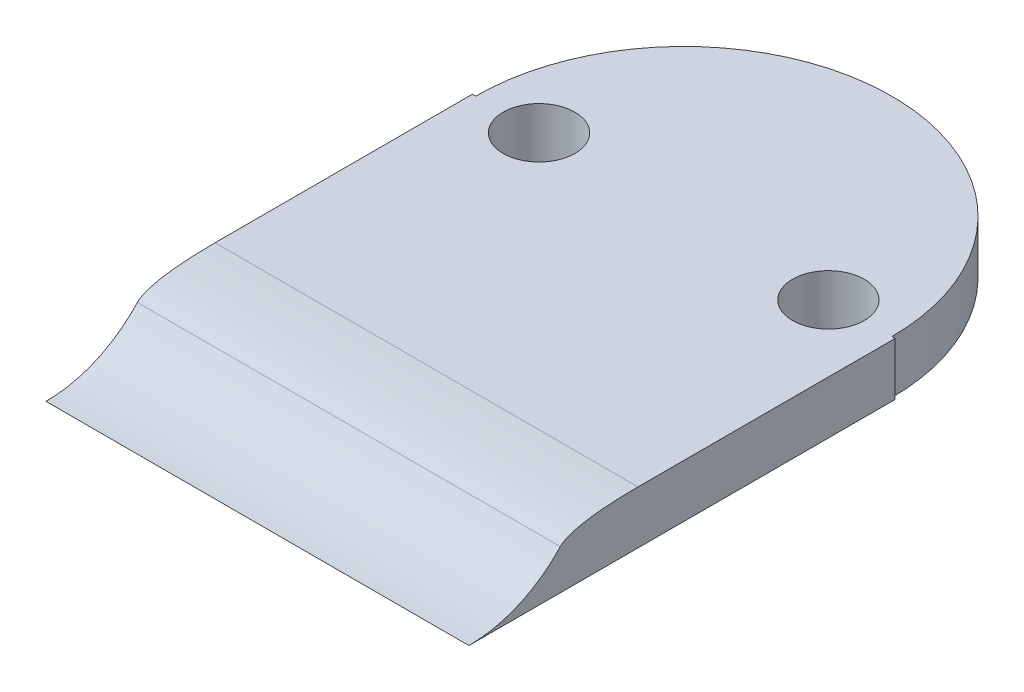
ISO-10303-21;
HEADER;
FILE_DESCRIPTION(('STEP AP214'),'2;1');
FILE_NAME('part.step','',(''),(''),'','','');
FILE_SCHEMA(('AUTOMOTIVE_DESIGN { 1 0 10303 214 1 1 1 1 }'));
ENDSEC;
DATA;
#1=APPLICATION_CONTEXT('core data for automotive mechanical design processes');
#2=APPLICATION_PROTOCOL_DEFINITION('international standard','automotive_design',2000,#1);
#3=PRODUCT_CONTEXT('',#1,'mechanical');
#4=PRODUCT('Part','Part','',(#3));
#5=PRODUCT_RELATED_PRODUCT_CATEGORY('part','',(#4));
#6=PRODUCT_DEFINITION_FORMATION('','',#4);
#7=PRODUCT_DEFINITION_CONTEXT('part definition',#1,'design');
#8=PRODUCT_DEFINITION('design','',#6,#7);
#9=PRODUCT_DEFINITION_SHAPE('','',#8);
#10=(LENGTH_UNIT() NAMED_UNIT(*) SI_UNIT(.MILLI.,.METRE.));
#11=(NAMED_UNIT(*) PLANE_ANGLE_UNIT() SI_UNIT($,.RADIAN.));
#12=(NAMED_UNIT(*) SI_UNIT($,.STERADIAN.) SOLID_ANGLE_UNIT());
#13=UNCERTAINTY_MEASURE_WITH_UNIT(LENGTH_MEASURE(1.E-05),#10,'distance_accuracy_value','');
#14=(GEOMETRIC_REPRESENTATION_CONTEXT(3) GLOBAL_UNCERTAINTY_ASSIGNED_CONTEXT((#13)) GLOBAL_UNIT_ASSIGNED_CONTEXT((#10,
#11,#12)) REPRESENTATION_CONTEXT('',''));
#15=CARTESIAN_POINT('',(0.,0.,0.));
#16=DIRECTION('',(0.,0.,1.));
#17=DIRECTION('',(1.,0.,0.));
#18=AXIS2_PLACEMENT_3D('',#15,#16,#17);
#19=CARTESIAN_POINT('',(12.7,88.9,0.));
#20=DIRECTION('',(0.,-1.,0.));
#21=DIRECTION('',(1.,0.,0.));
#22=AXIS2_PLACEMENT_3D('',#19,#20,#21);
#23=PLANE('',#22);
#24=CARTESIAN_POINT('',(-8.68927197393336,88.9,-19.05));
#25=DIRECTION('',(0.,-1.,0.));
#26=DIRECTION('',(1.,0.,0.));
#27=AXIS2_PLACEMENT_3D('',#24,#25,#26);
#28=CIRCLE('',#27,2.15264999999999);
#29=CARTESIAN_POINT('',(-6.53662197393337,88.9,-19.05));
#30=VERTEX_POINT('',#29);
#31=EDGE_CURVE('E168',#30,#30,#28,.T.);
#32=ORIENTED_EDGE('',*,*,#31,.T.);
#33=EDGE_LOOP('',(#32));
#34=FACE_BOUND('',#33,.T.);
#35=CARTESIAN_POINT('',(8.69072802606665,88.9,-19.05));
#36=DIRECTION('',(0.,-1.,0.));
#37=DIRECTION('',(1.,0.,0.));
#38=AXIS2_PLACEMENT_3D('',#35,#36,#37);
#39=CIRCLE('',#38,2.15264999999999);
#40=CARTESIAN_POINT('',(10.8433780260666,88.9,-19.05));
#41=VERTEX_POINT('',#40);
#42=EDGE_CURVE('E173',#41,#41,#39,.T.);
#43=ORIENTED_EDGE('',*,*,#42,.T.);
#44=EDGE_LOOP('',(#43));
#45=FACE_BOUND('',#44,.T.);
#46=DIRECTION('',(0.,0.,1.));
#47=VECTOR('',#46,1.);
#48=CARTESIAN_POINT('',(-12.7,88.9,0.));
#49=LINE('',#48,#47);
#50=CARTESIAN_POINT('',(-12.7,88.9,-19.05));
#51=VERTEX_POINT('',#50);
#52=CARTESIAN_POINT('',(-12.7,88.9,-3.60372173028903));
#53=VERTEX_POINT('',#52);
#54=EDGE_CURVE('E186',#51,#53,#49,.T.);
#55=ORIENTED_EDGE('',*,*,#54,.T.);
#56=CARTESIAN_POINT('',(13.97,88.9,-3.60372173028903));
#57=CARTESIAN_POINT('',(4.65666666666666,88.9,-3.60372173028903));
#58=CARTESIAN_POINT('',(-4.65666666666668,88.9,-3.60372173028903));
#59=CARTESIAN_POINT('',(-13.97,88.9,-3.60372173028903));
#60=(BOUNDED_CURVE() B_SPLINE_CURVE(3,(#56,#57,#58,#59),.UNSPECIFIED.,.F.,
.F.) B_SPLINE_CURVE_WITH_KNOTS((4,4),(-0.00127,0.02667),
.UNSPECIFIED.) CURVE() GEOMETRIC_REPRESENTATION_ITEM() RATIONAL_B_SPLINE_CURVE((1.,1.,1.,1.)) REPRESENTATION_ITEM(''));
#61=CARTESIAN_POINT('',(12.7,88.9,-3.60372173028903));
#62=VERTEX_POINT('',#61);
#63=EDGE_CURVE('E89',#53,#62,#60,.F.);
#64=ORIENTED_EDGE('',*,*,#63,.T.);
#65=DIRECTION('',(0.,0.,1.));
#66=VECTOR('',#65,1.);
#67=CARTESIAN_POINT('',(12.7,88.9,0.));
#68=LINE('',#67,#66);
#69=CARTESIAN_POINT('',(12.7,88.9,-19.05));
#70=VERTEX_POINT('',#69);
#71=EDGE_CURVE('E153',#70,#62,#68,.T.);
#72=ORIENTED_EDGE('',*,*,#71,.F.);
#73=DIRECTION('',(-1.,0.,0.));
#74=VECTOR('',#73,1.);
#75=CARTESIAN_POINT('',(12.7000000000003,88.9,-19.05));
#76=LINE('',#75,#74);
#77=CARTESIAN_POINT('',(12.5007280260666,88.9,-19.05));
#78=VERTEX_POINT('',#77);
#79=EDGE_CURVE('E287',#70,#78,#76,.T.);
#80=ORIENTED_EDGE('',*,*,#79,.T.);
#81=CARTESIAN_POINT('',(0.000728026066644889,88.9,-19.05));
#82=DIRECTION('',(0.,-1.,0.));
#83=DIRECTION('',(1.,0.,0.));
#84=AXIS2_PLACEMENT_3D('',#81,#82,#83);
#85=CIRCLE('',#84,12.5);
#86=CARTESIAN_POINT('',(-12.4992719739334,88.9,-19.05));
#87=VERTEX_POINT('',#86);
#88=EDGE_CURVE('E177',#87,#78,#85,.T.);
#89=ORIENTED_EDGE('',*,*,#88,.F.);
#90=DIRECTION('',(-1.,0.,0.));
#91=VECTOR('',#90,1.);
#92=CARTESIAN_POINT('',(12.6999999999997,88.9,-19.0500000000004));
#93=LINE('',#92,#91);
#94=EDGE_CURVE('E170',#87,#51,#93,.T.);
#95=ORIENTED_EDGE('',*,*,#94,.T.);
#96=EDGE_LOOP('',(#55,#64,#72,#80,#89,#95));
#97=FACE_BOUND('',#96,.T.);
#98=ADVANCED_FACE('F75',(#34,#45,#97),#23,.F.);
#99=CARTESIAN_POINT('',(-12.7,85.725,0.));
#100=DIRECTION('',(1.,0.,0.));
#101=DIRECTION('',(0.,1.,0.));
#102=AXIS2_PLACEMENT_3D('',#99,#100,#101);
#103=PLANE('',#102);
#104=DIRECTION('',(0.,1.,0.));
#105=VECTOR('',#104,1.);
#106=CARTESIAN_POINT('',(-12.7,55.753,-19.05));
#107=LINE('',#106,#105);
#108=CARTESIAN_POINT('',(-12.7,85.725,-19.05));
#109=VERTEX_POINT('',#108);
#110=EDGE_CURVE('E158',#109,#51,#107,.T.);
#111=ORIENTED_EDGE('',*,*,#110,.F.);
#112=DIRECTION('',(0.,0.,1.));
#113=VECTOR('',#112,1.);
#114=CARTESIAN_POINT('',(-12.7,85.725,0.));
#115=LINE('',#114,#113);
#116=CARTESIAN_POINT('',(-12.7,85.725,6.55));
#117=VERTEX_POINT('',#116);
#118=EDGE_CURVE('E144',#109,#117,#115,.T.);
#119=ORIENTED_EDGE('',*,*,#118,.T.);
#120=CARTESIAN_POINT('',(-12.7,93.1945826744818,6.55));
#121=DIRECTION('',(-1.,0.,0.));
#122=DIRECTION('',(0.,-1.,0.));
#123=AXIS2_PLACEMENT_3D('',#120,#121,#122);
#124=CIRCLE('',#123,7.46958267448183);
#125=CARTESIAN_POINT('',(-12.7,88.1275540980612,1.06184122526909));
#126=VERTEX_POINT('',#125);
#127=EDGE_CURVE('E157',#117,#126,#124,.F.);
#128=ORIENTED_EDGE('',*,*,#127,.T.);
#129=CARTESIAN_POINT('',(-12.7,88.9,-3.60372173028903));
#130=CARTESIAN_POINT('',(-12.7,88.9,0.348668443737298));
#131=CARTESIAN_POINT('',(-12.7,88.1275540980612,1.06184122526909));
#132=(BOUNDED_CURVE() B_SPLINE_CURVE(2,(#129,#130,#131),.UNSPECIFIED.,.F.,
.F.) B_SPLINE_CURVE_WITH_KNOTS((3,3),(0.,1.),
.UNSPECIFIED.) CURVE() GEOMETRIC_REPRESENTATION_ITEM() RATIONAL_B_SPLINE_CURVE((1.,
0.916066312030037,1.)) REPRESENTATION_ITEM(''));
#133=EDGE_CURVE('E104',#126,#53,#132,.F.);
#134=ORIENTED_EDGE('',*,*,#133,.T.);
#135=ORIENTED_EDGE('',*,*,#54,.F.);
#136=EDGE_LOOP('',(#111,#119,#128,#134,#135));
#137=FACE_BOUND('',#136,.T.);
#138=ADVANCED_FACE('F156',(#137),#103,.F.);
#139=CARTESIAN_POINT('',(12.7,85.725,0.));
#140=DIRECTION('',(-1.,0.,0.));
#141=DIRECTION('',(0.,-1.,0.));
#142=AXIS2_PLACEMENT_3D('',#139,#140,#141);
#143=PLANE('',#142);
#144=CARTESIAN_POINT('',(12.7,93.1945826744818,6.55));
#145=DIRECTION('',(-1.,0.,0.));
#146=DIRECTION('',(0.,-1.,0.));
#147=AXIS2_PLACEMENT_3D('',#144,#145,#146);
#148=CIRCLE('',#147,7.46958267448183);
#149=CARTESIAN_POINT('',(12.7,85.725,6.55));
#150=VERTEX_POINT('',#149);
#151=CARTESIAN_POINT('',(12.7,88.1275540980612,1.06184122526909));
#152=VERTEX_POINT('',#151);
#153=EDGE_CURVE('E167',#150,#152,#148,.F.);
#154=ORIENTED_EDGE('',*,*,#153,.F.);
#155=DIRECTION('',(0.,0.,-1.));
#156=VECTOR('',#155,1.);
#157=CARTESIAN_POINT('',(12.7,85.725,0.));
#158=LINE('',#157,#156);
#159=CARTESIAN_POINT('',(12.7,85.725,-19.05));
#160=VERTEX_POINT('',#159);
#161=EDGE_CURVE('E147',#150,#160,#158,.T.);
#162=ORIENTED_EDGE('',*,*,#161,.T.);
#163=DIRECTION('',(0.,1.,0.));
#164=VECTOR('',#163,1.);
#165=CARTESIAN_POINT('',(12.7,55.753,-19.05));
#166=LINE('',#165,#164);
#167=EDGE_CURVE('E278',#160,#70,#166,.T.);
#168=ORIENTED_EDGE('',*,*,#167,.T.);
#169=ORIENTED_EDGE('',*,*,#71,.T.);
#170=CARTESIAN_POINT('',(12.7,88.1275540980612,1.06184122526909));
#171=CARTESIAN_POINT('',(12.7,88.9,0.348668443737295));
#172=CARTESIAN_POINT('',(12.7,88.9,-3.60372173028903));
#173=(BOUNDED_CURVE() B_SPLINE_CURVE(2,(#170,#171,#172),.UNSPECIFIED.,.F.,
.F.) B_SPLINE_CURVE_WITH_KNOTS((3,3),(0.,1.),
.UNSPECIFIED.) CURVE() GEOMETRIC_REPRESENTATION_ITEM() RATIONAL_B_SPLINE_CURVE((1.,
0.916066312030038,1.)) REPRESENTATION_ITEM(''));
#174=EDGE_CURVE('E14',#62,#152,#173,.F.);
#175=ORIENTED_EDGE('',*,*,#174,.T.);
#176=EDGE_LOOP('',(#154,#162,#168,#169,#175));
#177=FACE_BOUND('',#176,.T.);
#178=ADVANCED_FACE('F222',(#177),#143,.F.);
#179=CARTESIAN_POINT('',(0.000728026066649417,55.753,-19.05));
#180=DIRECTION('',(0.,1.,0.));
#181=DIRECTION('',(-1.,0.,0.));
#182=AXIS2_PLACEMENT_3D('',#179,#180,#181);
#183=CYLINDRICAL_SURFACE('',#182,12.5);
#184=CARTESIAN_POINT('',(0.000728026066645323,85.725,-19.05));
#185=DIRECTION('',(0.,1.,0.));
#186=DIRECTION('',(-1.,0.,0.));
#187=AXIS2_PLACEMENT_3D('',#184,#185,#186);
#188=CIRCLE('',#187,12.5);
#189=CARTESIAN_POINT('',(-12.4992719739334,85.725,-19.05));
#190=VERTEX_POINT('',#189);
#191=CARTESIAN_POINT('',(12.5007280260666,85.725,-19.05));
#192=VERTEX_POINT('',#191);
#193=EDGE_CURVE('E296',#190,#192,#188,.F.);
#194=ORIENTED_EDGE('',*,*,#193,.F.);
#195=DIRECTION('',(0.,1.,0.));
#196=VECTOR('',#195,1.);
#197=CARTESIAN_POINT('',(-12.4992719739334,55.753,-19.05));
#198=LINE('',#197,#196);
#199=EDGE_CURVE('E83',#190,#87,#198,.T.);
#200=ORIENTED_EDGE('',*,*,#199,.T.);
#201=ORIENTED_EDGE('',*,*,#88,.T.);
#202=DIRECTION('',(0.,1.,0.));
#203=VECTOR('',#202,1.);
#204=CARTESIAN_POINT('',(12.5007280260666,55.753,-19.05));
#205=LINE('',#204,#203);
#206=EDGE_CURVE('E152',#192,#78,#205,.T.);
#207=ORIENTED_EDGE('',*,*,#206,.F.);
#208=EDGE_LOOP('',(#194,#200,#201,#207));
#209=FACE_BOUND('',#208,.T.);
#210=ADVANCED_FACE('F216',(#209),#183,.T.);
#211=CARTESIAN_POINT('',(-3.25172302705533E-13,55.753,-19.0500000000002));
#212=DIRECTION('',(0.,0.,-1.));
#213=DIRECTION('',(-1.,0.,0.));
#214=AXIS2_PLACEMENT_3D('',#211,#212,#213);
#215=PLANE('',#214);
#216=DIRECTION('',(1.,0.,0.));
#217=VECTOR('',#216,1.);
#218=CARTESIAN_POINT('',(-3.29266250108838E-13,85.725,-19.0500000000002));
#219=LINE('',#218,#217);
#220=EDGE_CURVE('E160',#109,#190,#219,.T.);
#221=ORIENTED_EDGE('',*,*,#220,.F.);
#222=ORIENTED_EDGE('',*,*,#110,.T.);
#223=ORIENTED_EDGE('',*,*,#94,.F.);
#224=ORIENTED_EDGE('',*,*,#199,.F.);
#225=EDGE_LOOP('',(#221,#222,#223,#224));
#226=FACE_BOUND('',#225,.T.);
#227=ADVANCED_FACE('F212',(#226),#215,.T.);
#228=CARTESIAN_POINT('',(3.33360197512138E-13,55.753,-19.0500000000002));
#229=DIRECTION('',(0.,0.,1.));
#230=DIRECTION('',(1.,0.,0.));
#231=AXIS2_PLACEMENT_3D('',#228,#229,#230);
#232=PLANE('',#231);
#233=ORIENTED_EDGE('',*,*,#167,.F.);
#234=DIRECTION('',(-1.,0.,0.));
#235=VECTOR('',#234,1.);
#236=CARTESIAN_POINT('',(3.29266250108832E-13,85.725,-19.0500000000002));
#237=LINE('',#236,#235);
#238=EDGE_CURVE('E298',#160,#192,#237,.T.);
#239=ORIENTED_EDGE('',*,*,#238,.T.);
#240=ORIENTED_EDGE('',*,*,#206,.T.);
#241=ORIENTED_EDGE('',*,*,#79,.F.);
#242=EDGE_LOOP('',(#233,#239,#240,#241));
#243=FACE_BOUND('',#242,.T.);
#244=ADVANCED_FACE('F215',(#243),#232,.F.);
#245=CARTESIAN_POINT('',(12.7,85.725,0.));
#246=DIRECTION('',(0.,1.,0.));
#247=DIRECTION('',(-1.,0.,0.));
#248=AXIS2_PLACEMENT_3D('',#245,#246,#247);
#249=PLANE('',#248);
#250=CARTESIAN_POINT('',(8.69072802606665,85.725,-19.05));
#251=DIRECTION('',(0.,-1.,0.));
#252=DIRECTION('',(1.,0.,0.));
#253=AXIS2_PLACEMENT_3D('',#250,#251,#252);
#254=CIRCLE('',#253,2.15264999999999);
#255=CARTESIAN_POINT('',(10.8433780260666,85.725,-19.05));
#256=VERTEX_POINT('',#255);
#257=EDGE_CURVE('E159',#256,#256,#254,.T.);
#258=ORIENTED_EDGE('',*,*,#257,.F.);
#259=EDGE_LOOP('',(#258));
#260=FACE_BOUND('',#259,.T.);
#261=CARTESIAN_POINT('',(-8.68927197393336,85.725,-19.05));
#262=DIRECTION('',(0.,-1.,0.));
#263=DIRECTION('',(1.,0.,0.));
#264=AXIS2_PLACEMENT_3D('',#261,#262,#263);
#265=CIRCLE('',#264,2.15264999999999);
#266=CARTESIAN_POINT('',(-6.53662197393337,85.725,-19.05));
#267=VERTEX_POINT('',#266);
#268=EDGE_CURVE('E276',#267,#267,#265,.T.);
#269=ORIENTED_EDGE('',*,*,#268,.F.);
#270=EDGE_LOOP('',(#269));
#271=FACE_BOUND('',#270,.T.);
#272=ORIENTED_EDGE('',*,*,#220,.T.);
#273=ORIENTED_EDGE('',*,*,#193,.T.);
#274=ORIENTED_EDGE('',*,*,#238,.F.);
#275=ORIENTED_EDGE('',*,*,#161,.F.);
#276=DIRECTION('',(-1.,0.,0.));
#277=VECTOR('',#276,1.);
#278=CARTESIAN_POINT('',(12.7,85.725,6.55));
#279=LINE('',#278,#277);
#280=EDGE_CURVE('E141',#150,#117,#279,.T.);
#281=ORIENTED_EDGE('',*,*,#280,.T.);
#282=ORIENTED_EDGE('',*,*,#118,.F.);
#283=EDGE_LOOP('',(#272,#273,#274,#275,#281,#282));
#284=FACE_BOUND('',#283,.T.);
#285=ADVANCED_FACE('F143',(#260,#271,#284),#249,.F.);
#286=CARTESIAN_POINT('',(12.7,93.1945826744818,6.55));
#287=DIRECTION('',(-1.,0.,0.));
#288=DIRECTION('',(0.,-1.,0.));
#289=AXIS2_PLACEMENT_3D('',#286,#287,#288);
#290=CYLINDRICAL_SURFACE('',#289,7.46958267448183);
#291=ORIENTED_EDGE('',*,*,#153,.T.);
#292=CARTESIAN_POINT('',(-13.97,88.1275540980612,1.06184122526909));
#293=CARTESIAN_POINT('',(-4.65666666666668,88.1275540980612,1.06184122526909));
#294=CARTESIAN_POINT('',(4.65666666666665,88.1275540980612,1.06184122526909));
#295=CARTESIAN_POINT('',(13.97,88.1275540980612,1.06184122526909));
#296=(BOUNDED_CURVE() B_SPLINE_CURVE(3,(#292,#293,#294,#295),.UNSPECIFIED.,.F.,
.F.) B_SPLINE_CURVE_WITH_KNOTS((4,4),(-0.00127,0.02667),
.UNSPECIFIED.) CURVE() GEOMETRIC_REPRESENTATION_ITEM() RATIONAL_B_SPLINE_CURVE((1.,1.,1.,1.)) REPRESENTATION_ITEM(''));
#297=EDGE_CURVE('E165',#152,#126,#296,.F.);
#298=ORIENTED_EDGE('',*,*,#297,.T.);
#299=ORIENTED_EDGE('',*,*,#127,.F.);
#300=ORIENTED_EDGE('',*,*,#280,.F.);
#301=EDGE_LOOP('',(#291,#298,#299,#300));
#302=FACE_BOUND('',#301,.T.);
#303=ADVANCED_FACE('F163',(#302),#290,.F.);
#304=CARTESIAN_POINT('',(13.97,88.1275540980612,1.06184122526909));
#305=CARTESIAN_POINT('',(4.65666666666665,88.1275540980612,1.06184122526909));
#306=CARTESIAN_POINT('',(-4.65666666666668,88.1275540980612,1.06184122526909));
#307=CARTESIAN_POINT('',(-13.97,88.1275540980612,1.06184122526909));
#308=CARTESIAN_POINT('',(13.97,88.9,0.348668443737295));
#309=CARTESIAN_POINT('',(4.65666666666666,88.9,0.348668443737295));
#310=CARTESIAN_POINT('',(-4.65666666666669,88.9,0.348668443737298));
#311=CARTESIAN_POINT('',(-13.97,88.9,0.348668443737298));
#312=CARTESIAN_POINT('',(13.97,88.9,-3.60372173028903));
#313=CARTESIAN_POINT('',(4.65666666666666,88.9,-3.60372173028903));
#314=CARTESIAN_POINT('',(-4.65666666666668,88.9,-3.60372173028903));
#315=CARTESIAN_POINT('',(-13.97,88.9,-3.60372173028903));
#316=(BOUNDED_SURFACE() B_SPLINE_SURFACE(2,3,((#304,#305,#306,#307),(#308,#309,#310,#311),(#312,
#313,#314,#315)),.UNSPECIFIED.,.F.,.F.,.F.) B_SPLINE_SURFACE_WITH_KNOTS((3,3),(4,4),(0.,1.),
(-0.00127,0.02667),
.UNSPECIFIED.) GEOMETRIC_REPRESENTATION_ITEM() RATIONAL_B_SPLINE_SURFACE(((1.,1.,1.,1.),
(0.916066312030038,0.916066312030038,0.916066312030037,0.916066312030037),(1.,1.,1.,1.))) REPRESENTATION_ITEM('') SURFACE());
#317=ORIENTED_EDGE('',*,*,#174,.F.);
#318=ORIENTED_EDGE('',*,*,#63,.F.);
#319=ORIENTED_EDGE('',*,*,#133,.F.);
#320=ORIENTED_EDGE('',*,*,#297,.F.);
#321=EDGE_LOOP('',(#317,#318,#319,#320));
#322=FACE_BOUND('',#321,.T.);
#323=ADVANCED_FACE('F78',(#322),#316,.T.);
#324=CARTESIAN_POINT('',(8.69072802606664,165.1,-19.05));
#325=DIRECTION('',(0.,-1.,0.));
#326=DIRECTION('',(1.,0.,0.));
#327=AXIS2_PLACEMENT_3D('',#324,#325,#326);
#328=CYLINDRICAL_SURFACE('',#327,2.15264999999999);
#329=CARTESIAN_POINT('',(10.8433780260666,85.725,-19.05));
#330=CARTESIAN_POINT('',(10.8433780260666,85.7580729166667,-19.05));
#331=CARTESIAN_POINT('',(10.8433780260666,85.7911458333333,-19.05));
#332=CARTESIAN_POINT('',(10.8433780260666,85.8572916666667,-19.05));
#333=CARTESIAN_POINT('',(10.8433780260666,85.8903645833333,-19.05));
#334=CARTESIAN_POINT('',(10.8433780260666,85.9565104166667,-19.05));
#335=CARTESIAN_POINT('',(10.8433780260666,85.9895833333333,-19.05));
#336=CARTESIAN_POINT('',(10.8433780260666,86.0557291666667,-19.05));
#337=CARTESIAN_POINT('',(10.8433780260666,86.0888020833333,-19.05));
#338=CARTESIAN_POINT('',(10.8433780260666,86.1549479166667,-19.05));
#339=CARTESIAN_POINT('',(10.8433780260666,86.1880208333333,-19.05));
#340=CARTESIAN_POINT('',(10.8433780260666,86.2541666666667,-19.05));
#341=CARTESIAN_POINT('',(10.8433780260666,86.2872395833333,-19.05));
#342=CARTESIAN_POINT('',(10.8433780260666,86.3533854166667,-19.05));
#343=CARTESIAN_POINT('',(10.8433780260666,86.3864583333334,-19.05));
#344=CARTESIAN_POINT('',(10.8433780260666,86.4526041666667,-19.05));
#345=CARTESIAN_POINT('',(10.8433780260666,86.4856770833334,-19.05));
#346=CARTESIAN_POINT('',(10.8433780260666,86.5518229166667,-19.05));
#347=CARTESIAN_POINT('',(10.8433780260666,86.5848958333333,-19.05));
#348=CARTESIAN_POINT('',(10.8433780260666,86.6510416666667,-19.05));
#349=CARTESIAN_POINT('',(10.8433780260666,86.6841145833333,-19.05));
#350=CARTESIAN_POINT('',(10.8433780260666,86.7502604166667,-19.05));
#351=CARTESIAN_POINT('',(10.8433780260666,86.7833333333333,-19.05));
#352=CARTESIAN_POINT('',(10.8433780260666,86.8494791666667,-19.05));
#353=CARTESIAN_POINT('',(10.8433780260666,86.8825520833333,-19.05));
#354=CARTESIAN_POINT('',(10.8433780260666,86.9486979166667,-19.05));
#355=CARTESIAN_POINT('',(10.8433780260666,86.9817708333333,-19.05));
#356=CARTESIAN_POINT('',(10.8433780260666,87.0479166666667,-19.05));
#357=CARTESIAN_POINT('',(10.8433780260666,87.0809895833333,-19.05));
#358=CARTESIAN_POINT('',(10.8433780260666,87.1471354166667,-19.05));
#359=CARTESIAN_POINT('',(10.8433780260666,87.1802083333333,-19.05));
#360=CARTESIAN_POINT('',(10.8433780260666,87.2463541666667,-19.05));
#361=CARTESIAN_POINT('',(10.8433780260666,87.2794270833333,-19.05));
#362=CARTESIAN_POINT('',(10.8433780260666,87.3455729166667,-19.05));
#363=CARTESIAN_POINT('',(10.8433780260666,87.3786458333334,-19.05));
#364=CARTESIAN_POINT('',(10.8433780260666,87.4447916666667,-19.05));
#365=CARTESIAN_POINT('',(10.8433780260666,87.4778645833333,-19.05));
#366=CARTESIAN_POINT('',(10.8433780260666,87.5440104166667,-19.05));
#367=CARTESIAN_POINT('',(10.8433780260666,87.5770833333333,-19.05));
#368=CARTESIAN_POINT('',(10.8433780260666,87.6432291666667,-19.05));
#369=CARTESIAN_POINT('',(10.8433780260666,87.6763020833334,-19.05));
#370=CARTESIAN_POINT('',(10.8433780260666,87.7424479166667,-19.05));
#371=CARTESIAN_POINT('',(10.8433780260666,87.7755208333333,-19.05));
#372=CARTESIAN_POINT('',(10.8433780260666,87.8416666666667,-19.05));
#373=CARTESIAN_POINT('',(10.8433780260666,87.8747395833334,-19.05));
#374=CARTESIAN_POINT('',(10.8433780260666,87.9408854166667,-19.05));
#375=CARTESIAN_POINT('',(10.8433780260666,87.9739583333334,-19.05));
#376=CARTESIAN_POINT('',(10.8433780260666,88.0401041666667,-19.05));
#377=CARTESIAN_POINT('',(10.8433780260666,88.0731770833333,-19.05));
#378=CARTESIAN_POINT('',(10.8433780260666,88.1393229166667,-19.05));
#379=CARTESIAN_POINT('',(10.8433780260666,88.1723958333334,-19.05));
#380=CARTESIAN_POINT('',(10.8433780260666,88.2385416666667,-19.05));
#381=CARTESIAN_POINT('',(10.8433780260666,88.2716145833333,-19.05));
#382=CARTESIAN_POINT('',(10.8433780260666,88.3377604166667,-19.05));
#383=CARTESIAN_POINT('',(10.8433780260666,88.3708333333334,-19.05));
#384=CARTESIAN_POINT('',(10.8433780260666,88.4369791666667,-19.05));
#385=CARTESIAN_POINT('',(10.8433780260666,88.4700520833333,-19.05));
#386=CARTESIAN_POINT('',(10.8433780260666,88.5361979166667,-19.05));
#387=CARTESIAN_POINT('',(10.8433780260666,88.5692708333333,-19.05));
#388=CARTESIAN_POINT('',(10.8433780260666,88.6354166666667,-19.05));
#389=CARTESIAN_POINT('',(10.8433780260666,88.6684895833334,-19.05));
#390=CARTESIAN_POINT('',(10.8433780260666,88.7346354166667,-19.05));
#391=CARTESIAN_POINT('',(10.8433780260666,88.7677083333333,-19.05));
#392=CARTESIAN_POINT('',(10.8433780260666,88.8338541666667,-19.05));
#393=CARTESIAN_POINT('',(10.8433780260666,88.8669270833334,-19.05));
#394=CARTESIAN_POINT('',(10.8433780260666,88.9,-19.05));
#395=B_SPLINE_CURVE_WITH_KNOTS('',3,(#329,#330,#331,#332,#333,#334,#335,#336,#337,#338,#339,
#340,#341,#342,#343,#344,#345,#346,#347,#348,#349,#350,#351,#352,#353,#354,#355,#356,#357,#358,
#359,#360,#361,#362,#363,#364,#365,#366,#367,#368,#369,#370,#371,#372,#373,#374,#375,#376,#377,
#378,#379,#380,#381,#382,#383,#384,#385,#386,#387,#388,#389,#390,#391,#392,#393,#394),
.UNSPECIFIED.,.F.,.F.,(4,2,2,2,2,2,2,2,2,2,2,2,2,2,2,2,2,2,2,2,2,2,2,2,2,2,2,2,2,2,2,2,4),(0.,
0.0992187500000047,0.198437499999995,0.29765625,0.396875000000005,0.496093749999996,0.5953125,
0.694531250000005,0.79375000000001,0.892968750000001,0.992187500000005,1.09140625000001,
1.190625,1.28984375000001,1.38906250000001,1.48828125,1.58750000000001,1.68671875000001,
1.7859375,1.88515625000001,1.98437500000001,2.08359375,2.18281250000001,2.28203125000001,
2.38125,2.48046875000001,2.57968750000001,2.67890625000002,2.77812500000001,2.87734375000001,
2.97656250000002,3.07578125000001,3.17500000000001),.UNSPECIFIED.);
#396=EDGE_CURVE('BSEAM306',#256,#41,#395,.T.);
#397=ORIENTED_EDGE('',*,*,#257,.T.);
#398=ORIENTED_EDGE('',*,*,#42,.F.);
#399=ORIENTED_EDGE('',*,*,#396,.T.);
#400=ORIENTED_EDGE('',*,*,#396,.F.);
#401=EDGE_LOOP('',(#397,#399,#398,#400));
#402=FACE_BOUND('',#401,.T.);
#403=ADVANCED_FACE('F306',(#402),#328,.F.);
#404=CARTESIAN_POINT('',(-8.68927197393337,165.1,-19.05));
#405=DIRECTION('',(0.,-1.,0.));
#406=DIRECTION('',(1.,0.,0.));
#407=AXIS2_PLACEMENT_3D('',#404,#405,#406);
#408=CYLINDRICAL_SURFACE('',#407,2.15264999999999);
#409=CARTESIAN_POINT('',(-6.53662197393337,85.725,-19.05));
#410=CARTESIAN_POINT('',(-6.53662197393337,85.7580729166667,-19.05));
#411=CARTESIAN_POINT('',(-6.53662197393337,85.7911458333333,-19.05));
#412=CARTESIAN_POINT('',(-6.53662197393337,85.8572916666667,-19.05));
#413=CARTESIAN_POINT('',(-6.53662197393337,85.8903645833333,-19.05));
#414=CARTESIAN_POINT('',(-6.53662197393337,85.9565104166667,-19.05));
#415=CARTESIAN_POINT('',(-6.53662197393337,85.9895833333333,-19.05));
#416=CARTESIAN_POINT('',(-6.53662197393337,86.0557291666667,-19.05));
#417=CARTESIAN_POINT('',(-6.53662197393337,86.0888020833333,-19.05));
#418=CARTESIAN_POINT('',(-6.53662197393337,86.1549479166667,-19.05));
#419=CARTESIAN_POINT('',(-6.53662197393337,86.1880208333333,-19.05));
#420=CARTESIAN_POINT('',(-6.53662197393337,86.2541666666667,-19.05));
#421=CARTESIAN_POINT('',(-6.53662197393337,86.2872395833333,-19.05));
#422=CARTESIAN_POINT('',(-6.53662197393337,86.3533854166667,-19.05));
#423=CARTESIAN_POINT('',(-6.53662197393337,86.3864583333334,-19.05));
#424=CARTESIAN_POINT('',(-6.53662197393337,86.4526041666667,-19.05));
#425=CARTESIAN_POINT('',(-6.53662197393337,86.4856770833334,-19.05));
#426=CARTESIAN_POINT('',(-6.53662197393337,86.5518229166667,-19.05));
#427=CARTESIAN_POINT('',(-6.53662197393337,86.5848958333333,-19.05));
#428=CARTESIAN_POINT('',(-6.53662197393337,86.6510416666667,-19.05));
#429=CARTESIAN_POINT('',(-6.53662197393337,86.6841145833333,-19.05));
#430=CARTESIAN_POINT('',(-6.53662197393337,86.7502604166667,-19.05));
#431=CARTESIAN_POINT('',(-6.53662197393337,86.7833333333333,-19.05));
#432=CARTESIAN_POINT('',(-6.53662197393337,86.8494791666667,-19.05));
#433=CARTESIAN_POINT('',(-6.53662197393337,86.8825520833333,-19.05));
#434=CARTESIAN_POINT('',(-6.53662197393337,86.9486979166667,-19.05));
#435=CARTESIAN_POINT('',(-6.53662197393337,86.9817708333333,-19.05));
#436=CARTESIAN_POINT('',(-6.53662197393337,87.0479166666667,-19.05));
#437=CARTESIAN_POINT('',(-6.53662197393337,87.0809895833333,-19.05));
#438=CARTESIAN_POINT('',(-6.53662197393337,87.1471354166667,-19.05));
#439=CARTESIAN_POINT('',(-6.53662197393337,87.1802083333333,-19.05));
#440=CARTESIAN_POINT('',(-6.53662197393337,87.2463541666667,-19.05));
#441=CARTESIAN_POINT('',(-6.53662197393337,87.2794270833333,-19.05));
#442=CARTESIAN_POINT('',(-6.53662197393337,87.3455729166667,-19.05));
#443=CARTESIAN_POINT('',(-6.53662197393337,87.3786458333334,-19.05));
#444=CARTESIAN_POINT('',(-6.53662197393337,87.4447916666667,-19.05));
#445=CARTESIAN_POINT('',(-6.53662197393337,87.4778645833333,-19.05));
#446=CARTESIAN_POINT('',(-6.53662197393337,87.5440104166667,-19.05));
#447=CARTESIAN_POINT('',(-6.53662197393337,87.5770833333333,-19.05));
#448=CARTESIAN_POINT('',(-6.53662197393337,87.6432291666667,-19.05));
#449=CARTESIAN_POINT('',(-6.53662197393337,87.6763020833334,-19.05));
#450=CARTESIAN_POINT('',(-6.53662197393337,87.7424479166667,-19.05));
#451=CARTESIAN_POINT('',(-6.53662197393337,87.7755208333333,-19.05));
#452=CARTESIAN_POINT('',(-6.53662197393337,87.8416666666667,-19.05));
#453=CARTESIAN_POINT('',(-6.53662197393337,87.8747395833334,-19.05));
#454=CARTESIAN_POINT('',(-6.53662197393337,87.9408854166667,-19.05));
#455=CARTESIAN_POINT('',(-6.53662197393337,87.9739583333334,-19.05));
#456=CARTESIAN_POINT('',(-6.53662197393337,88.0401041666667,-19.05));
#457=CARTESIAN_POINT('',(-6.53662197393337,88.0731770833333,-19.05));
#458=CARTESIAN_POINT('',(-6.53662197393337,88.1393229166667,-19.05));
#459=CARTESIAN_POINT('',(-6.53662197393337,88.1723958333334,-19.05));
#460=CARTESIAN_POINT('',(-6.53662197393337,88.2385416666667,-19.05));
#461=CARTESIAN_POINT('',(-6.53662197393337,88.2716145833333,-19.05));
#462=CARTESIAN_POINT('',(-6.53662197393337,88.3377604166667,-19.05));
#463=CARTESIAN_POINT('',(-6.53662197393337,88.3708333333334,-19.05));
#464=CARTESIAN_POINT('',(-6.53662197393337,88.4369791666667,-19.05));
#465=CARTESIAN_POINT('',(-6.53662197393337,88.4700520833333,-19.05));
#466=CARTESIAN_POINT('',(-6.53662197393337,88.5361979166667,-19.05));
#467=CARTESIAN_POINT('',(-6.53662197393337,88.5692708333333,-19.05));
#468=CARTESIAN_POINT('',(-6.53662197393337,88.6354166666667,-19.05));
#469=CARTESIAN_POINT('',(-6.53662197393337,88.6684895833334,-19.05));
#470=CARTESIAN_POINT('',(-6.53662197393337,88.7346354166667,-19.05));
#471=CARTESIAN_POINT('',(-6.53662197393337,88.7677083333333,-19.05));
#472=CARTESIAN_POINT('',(-6.53662197393337,88.8338541666667,-19.05));
#473=CARTESIAN_POINT('',(-6.53662197393337,88.8669270833334,-19.05));
#474=CARTESIAN_POINT('',(-6.53662197393337,88.9,-19.05));
#475=B_SPLINE_CURVE_WITH_KNOTS('',3,(#409,#410,#411,#412,#413,#414,#415,#416,#417,#418,#419,
#420,#421,#422,#423,#424,#425,#426,#427,#428,#429,#430,#431,#432,#433,#434,#435,#436,#437,#438,
#439,#440,#441,#442,#443,#444,#445,#446,#447,#448,#449,#450,#451,#452,#453,#454,#455,#456,#457,
#458,#459,#460,#461,#462,#463,#464,#465,#466,#467,#468,#469,#470,#471,#472,#473,#474),
.UNSPECIFIED.,.F.,.F.,(4,2,2,2,2,2,2,2,2,2,2,2,2,2,2,2,2,2,2,2,2,2,2,2,2,2,2,2,2,2,2,2,4),(0.,
0.0992187500000047,0.198437499999995,0.29765625,0.396875000000005,0.496093749999996,0.5953125,
0.694531250000005,0.79375000000001,0.892968750000001,0.992187500000005,1.09140625000001,
1.190625,1.28984375000001,1.38906250000001,1.48828125,1.58750000000001,1.68671875000001,
1.7859375,1.88515625000001,1.98437500000001,2.08359375,2.18281250000001,2.28203125000001,
2.38125,2.48046875000001,2.57968750000001,2.67890625000002,2.77812500000001,2.87734375000001,
2.97656250000002,3.07578125000001,3.17500000000001),.UNSPECIFIED.);
#476=EDGE_CURVE('BSEAM313',#267,#30,#475,.T.);
#477=ORIENTED_EDGE('',*,*,#268,.T.);
#478=ORIENTED_EDGE('',*,*,#31,.F.);
#479=ORIENTED_EDGE('',*,*,#476,.T.);
#480=ORIENTED_EDGE('',*,*,#476,.F.);
#481=EDGE_LOOP('',(#477,#479,#478,#480));
#482=FACE_BOUND('',#481,.T.);
#483=ADVANCED_FACE('F313',(#482),#408,.F.);
#484=CLOSED_SHELL('',(#98,#138,#178,#210,#227,#244,#285,#303,#323,#403,#483));
#485=MANIFOLD_SOLID_BREP('B2',#484);
#486=ADVANCED_BREP_SHAPE_REPRESENTATION('',(#18,#485),#14);
#487=SHAPE_DEFINITION_REPRESENTATION(#9,#486);
ENDSEC;
END-ISO-10303-21;
